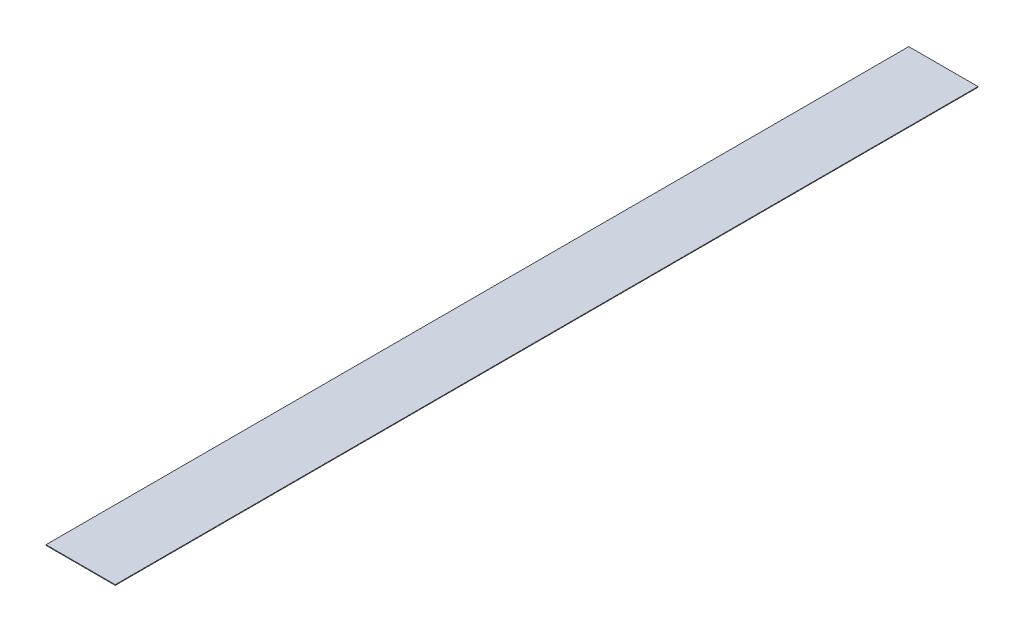
ISO-10303-21;
HEADER;
FILE_DESCRIPTION(('STEP AP214'),'2;1');
FILE_NAME('part.step','',(''),(''),'','','');
FILE_SCHEMA(('AUTOMOTIVE_DESIGN { 1 0 10303 214 1 1 1 1 }'));
ENDSEC;
DATA;
#1=APPLICATION_CONTEXT('core data for automotive mechanical design processes');
#2=APPLICATION_PROTOCOL_DEFINITION('international standard','automotive_design',2000,#1);
#3=PRODUCT_CONTEXT('',#1,'mechanical');
#4=PRODUCT('Part','Part','',(#3));
#5=PRODUCT_RELATED_PRODUCT_CATEGORY('part','',(#4));
#6=PRODUCT_DEFINITION_FORMATION('','',#4);
#7=PRODUCT_DEFINITION_CONTEXT('part definition',#1,'design');
#8=PRODUCT_DEFINITION('design','',#6,#7);
#9=PRODUCT_DEFINITION_SHAPE('','',#8);
#10=(LENGTH_UNIT() NAMED_UNIT(*) SI_UNIT(.MILLI.,.METRE.));
#11=(NAMED_UNIT(*) PLANE_ANGLE_UNIT() SI_UNIT($,.RADIAN.));
#12=(NAMED_UNIT(*) SI_UNIT($,.STERADIAN.) SOLID_ANGLE_UNIT());
#13=UNCERTAINTY_MEASURE_WITH_UNIT(LENGTH_MEASURE(1.E-05),#10,'distance_accuracy_value','');
#14=(GEOMETRIC_REPRESENTATION_CONTEXT(3) GLOBAL_UNCERTAINTY_ASSIGNED_CONTEXT((#13)) GLOBAL_UNIT_ASSIGNED_CONTEXT((#10,
#11,#12)) REPRESENTATION_CONTEXT('',''));
#15=CARTESIAN_POINT('',(0.,0.,0.));
#16=DIRECTION('',(0.,0.,1.));
#17=DIRECTION('',(1.,0.,0.));
#18=AXIS2_PLACEMENT_3D('',#15,#16,#17);
#19=CARTESIAN_POINT('',(-12.3027,0.22,-153.25));
#20=DIRECTION('',(1.,0.,0.));
#21=DIRECTION('',(0.,0.,-1.));
#22=AXIS2_PLACEMENT_3D('',#19,#20,#21);
#23=PLANE('',#22);
#24=DIRECTION('',(0.,0.,1.));
#25=VECTOR('',#24,1.);
#26=CARTESIAN_POINT('',(-12.3027,0.,-153.25));
#27=LINE('',#26,#25);
#28=CARTESIAN_POINT('',(-12.3027,0.,-153.25));
#29=VERTEX_POINT('',#28);
#30=CARTESIAN_POINT('',(-12.3027,0.,153.25));
#31=VERTEX_POINT('',#30);
#32=EDGE_CURVE('E98',#29,#31,#27,.T.);
#33=ORIENTED_EDGE('',*,*,#32,.T.);
#34=DIRECTION('',(0.,-1.,0.));
#35=VECTOR('',#34,1.);
#36=CARTESIAN_POINT('',(-12.3027,0.22,153.25));
#37=LINE('',#36,#35);
#38=CARTESIAN_POINT('',(-12.3027,0.22,153.25));
#39=VERTEX_POINT('',#38);
#40=EDGE_CURVE('E11',#39,#31,#37,.T.);
#41=ORIENTED_EDGE('',*,*,#40,.F.);
#42=DIRECTION('',(0.,0.,1.));
#43=VECTOR('',#42,1.);
#44=CARTESIAN_POINT('',(-12.3027,0.22,-153.25));
#45=LINE('',#44,#43);
#46=CARTESIAN_POINT('',(-12.3027,0.22,-153.25));
#47=VERTEX_POINT('',#46);
#48=EDGE_CURVE('E86',#47,#39,#45,.T.);
#49=ORIENTED_EDGE('',*,*,#48,.F.);
#50=DIRECTION('',(0.,-1.,0.));
#51=VECTOR('',#50,1.);
#52=CARTESIAN_POINT('',(-12.3027,0.22,-153.25));
#53=LINE('',#52,#51);
#54=EDGE_CURVE('E94',#47,#29,#53,.T.);
#55=ORIENTED_EDGE('',*,*,#54,.T.);
#56=EDGE_LOOP('',(#33,#41,#49,#55));
#57=FACE_BOUND('',#56,.T.);
#58=ADVANCED_FACE('F35',(#57),#23,.F.);
#59=CARTESIAN_POINT('',(-12.3027,0.22,153.25));
#60=DIRECTION('',(0.,0.,-1.));
#61=DIRECTION('',(-1.,0.,0.));
#62=AXIS2_PLACEMENT_3D('',#59,#60,#61);
#63=PLANE('',#62);
#64=DIRECTION('',(1.,0.,0.));
#65=VECTOR('',#64,1.);
#66=CARTESIAN_POINT('',(-12.3027,0.,153.25));
#67=LINE('',#66,#65);
#68=CARTESIAN_POINT('',(12.3027,0.,153.25));
#69=VERTEX_POINT('',#68);
#70=EDGE_CURVE('E90',#31,#69,#67,.T.);
#71=ORIENTED_EDGE('',*,*,#70,.T.);
#72=DIRECTION('',(0.,-1.,0.));
#73=VECTOR('',#72,1.);
#74=CARTESIAN_POINT('',(12.3027,0.22,153.25));
#75=LINE('',#74,#73);
#76=CARTESIAN_POINT('',(12.3027,0.22,153.25));
#77=VERTEX_POINT('',#76);
#78=EDGE_CURVE('E43',#77,#69,#75,.T.);
#79=ORIENTED_EDGE('',*,*,#78,.F.);
#80=DIRECTION('',(1.,0.,0.));
#81=VECTOR('',#80,1.);
#82=CARTESIAN_POINT('',(-12.3027,0.22,153.25));
#83=LINE('',#82,#81);
#84=EDGE_CURVE('E81',#39,#77,#83,.T.);
#85=ORIENTED_EDGE('',*,*,#84,.F.);
#86=ORIENTED_EDGE('',*,*,#40,.T.);
#87=EDGE_LOOP('',(#71,#79,#85,#86));
#88=FACE_BOUND('',#87,.T.);
#89=ADVANCED_FACE('F89',(#88),#63,.F.);
#90=CARTESIAN_POINT('',(12.3027,0.22,-153.25));
#91=DIRECTION('',(-1.,0.,0.));
#92=DIRECTION('',(0.,0.,1.));
#93=AXIS2_PLACEMENT_3D('',#90,#91,#92);
#94=PLANE('',#93);
#95=DIRECTION('',(0.,0.,-1.));
#96=VECTOR('',#95,1.);
#97=CARTESIAN_POINT('',(12.3027,0.,-153.25));
#98=LINE('',#97,#96);
#99=CARTESIAN_POINT('',(12.3027,0.,-153.25));
#100=VERTEX_POINT('',#99);
#101=EDGE_CURVE('E68',#69,#100,#98,.T.);
#102=ORIENTED_EDGE('',*,*,#101,.T.);
#103=DIRECTION('',(0.,-1.,0.));
#104=VECTOR('',#103,1.);
#105=CARTESIAN_POINT('',(12.3027,0.22,-153.25));
#106=LINE('',#105,#104);
#107=CARTESIAN_POINT('',(12.3027,0.22,-153.25));
#108=VERTEX_POINT('',#107);
#109=EDGE_CURVE('E91',#108,#100,#106,.T.);
#110=ORIENTED_EDGE('',*,*,#109,.F.);
#111=DIRECTION('',(0.,0.,-1.));
#112=VECTOR('',#111,1.);
#113=CARTESIAN_POINT('',(12.3027,0.22,-153.25));
#114=LINE('',#113,#112);
#115=EDGE_CURVE('E84',#77,#108,#114,.T.);
#116=ORIENTED_EDGE('',*,*,#115,.F.);
#117=ORIENTED_EDGE('',*,*,#78,.T.);
#118=EDGE_LOOP('',(#102,#110,#116,#117));
#119=FACE_BOUND('',#118,.T.);
#120=ADVANCED_FACE('F92',(#119),#94,.F.);
#121=CARTESIAN_POINT('',(-12.3027,0.22,-153.25));
#122=DIRECTION('',(0.,0.,1.));
#123=DIRECTION('',(1.,0.,0.));
#124=AXIS2_PLACEMENT_3D('',#121,#122,#123);
#125=PLANE('',#124);
#126=DIRECTION('',(-1.,0.,0.));
#127=VECTOR('',#126,1.);
#128=CARTESIAN_POINT('',(-12.3027,0.,-153.25));
#129=LINE('',#128,#127);
#130=EDGE_CURVE('E74',#100,#29,#129,.T.);
#131=ORIENTED_EDGE('',*,*,#130,.T.);
#132=ORIENTED_EDGE('',*,*,#54,.F.);
#133=DIRECTION('',(-1.,0.,0.));
#134=VECTOR('',#133,1.);
#135=CARTESIAN_POINT('',(-12.3027,0.22,-153.25));
#136=LINE('',#135,#134);
#137=EDGE_CURVE('E51',#108,#47,#136,.T.);
#138=ORIENTED_EDGE('',*,*,#137,.F.);
#139=ORIENTED_EDGE('',*,*,#109,.T.);
#140=EDGE_LOOP('',(#131,#132,#138,#139));
#141=FACE_BOUND('',#140,.T.);
#142=ADVANCED_FACE('F105',(#141),#125,.F.);
#143=CARTESIAN_POINT('',(-12.3027,0.22,153.25));
#144=DIRECTION('',(0.,1.,0.));
#145=DIRECTION('',(0.,0.,1.));
#146=AXIS2_PLACEMENT_3D('',#143,#144,#145);
#147=PLANE('',#146);
#148=ORIENTED_EDGE('',*,*,#48,.T.);
#149=ORIENTED_EDGE('',*,*,#84,.T.);
#150=ORIENTED_EDGE('',*,*,#115,.T.);
#151=ORIENTED_EDGE('',*,*,#137,.T.);
#152=EDGE_LOOP('',(#148,#149,#150,#151));
#153=FACE_BOUND('',#152,.T.);
#154=ADVANCED_FACE('F82',(#153),#147,.T.);
#155=CARTESIAN_POINT('',(-12.3027,0.,153.25));
#156=DIRECTION('',(0.,1.,0.));
#157=DIRECTION('',(0.,0.,1.));
#158=AXIS2_PLACEMENT_3D('',#155,#156,#157);
#159=PLANE('',#158);
#160=ORIENTED_EDGE('',*,*,#32,.F.);
#161=ORIENTED_EDGE('',*,*,#130,.F.);
#162=ORIENTED_EDGE('',*,*,#101,.F.);
#163=ORIENTED_EDGE('',*,*,#70,.F.);
#164=EDGE_LOOP('',(#160,#161,#162,#163));
#165=FACE_BOUND('',#164,.T.);
#166=ADVANCED_FACE('F108',(#165),#159,.F.);
#167=CLOSED_SHELL('',(#58,#89,#120,#142,#154,#166));
#168=MANIFOLD_SOLID_BREP('B2',#167);
#169=ADVANCED_BREP_SHAPE_REPRESENTATION('',(#18,#168),#14);
#170=SHAPE_DEFINITION_REPRESENTATION(#9,#169);
ENDSEC;
END-ISO-10303-21;
